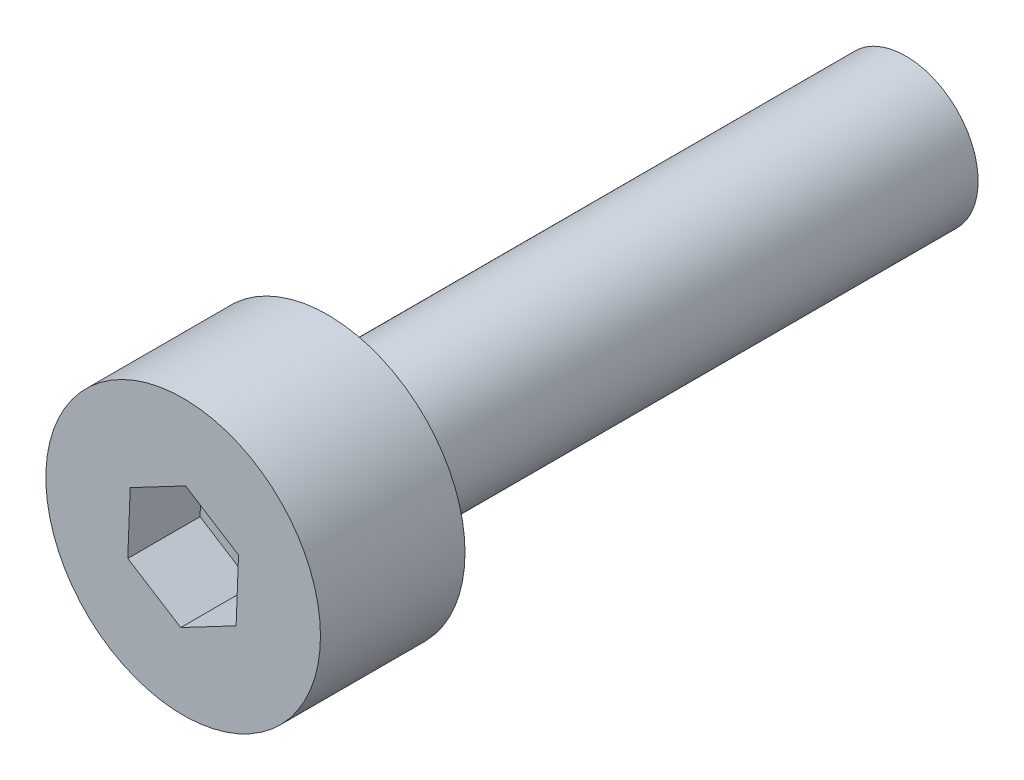
ISO-10303-21;
HEADER;
FILE_DESCRIPTION(('STEP AP214'),'2;1');
FILE_NAME('part.step','',(''),(''),'','','');
FILE_SCHEMA(('AUTOMOTIVE_DESIGN { 1 0 10303 214 1 1 1 1 }'));
ENDSEC;
DATA;
#1=APPLICATION_CONTEXT('core data for automotive mechanical design processes');
#2=APPLICATION_PROTOCOL_DEFINITION('international standard','automotive_design',2000,#1);
#3=PRODUCT_CONTEXT('',#1,'mechanical');
#4=PRODUCT('Part','Part','',(#3));
#5=PRODUCT_RELATED_PRODUCT_CATEGORY('part','',(#4));
#6=PRODUCT_DEFINITION_FORMATION('','',#4);
#7=PRODUCT_DEFINITION_CONTEXT('part definition',#1,'design');
#8=PRODUCT_DEFINITION('design','',#6,#7);
#9=PRODUCT_DEFINITION_SHAPE('','',#8);
#10=(LENGTH_UNIT() NAMED_UNIT(*) SI_UNIT(.MILLI.,.METRE.));
#11=(NAMED_UNIT(*) PLANE_ANGLE_UNIT() SI_UNIT($,.RADIAN.));
#12=(NAMED_UNIT(*) SI_UNIT($,.STERADIAN.) SOLID_ANGLE_UNIT());
#13=UNCERTAINTY_MEASURE_WITH_UNIT(LENGTH_MEASURE(1.E-05),#10,'distance_accuracy_value','');
#14=(GEOMETRIC_REPRESENTATION_CONTEXT(3) GLOBAL_UNCERTAINTY_ASSIGNED_CONTEXT((#13)) GLOBAL_UNIT_ASSIGNED_CONTEXT((#10,
#11,#12)) REPRESENTATION_CONTEXT('',''));
#15=CARTESIAN_POINT('',(0.,0.,0.));
#16=DIRECTION('',(0.,0.,1.));
#17=DIRECTION('',(1.,0.,0.));
#18=AXIS2_PLACEMENT_3D('',#15,#16,#17);
#19=CARTESIAN_POINT('',(0.,0.,2.));
#20=DIRECTION('',(0.,0.,-1.));
#21=DIRECTION('',(-1.,0.,0.));
#22=AXIS2_PLACEMENT_3D('',#19,#20,#21);
#23=CYLINDRICAL_SURFACE('',#22,1.9);
#24=CARTESIAN_POINT('',(0.,0.,2.));
#25=DIRECTION('',(0.,0.,1.));
#26=DIRECTION('',(1.,0.,0.));
#27=AXIS2_PLACEMENT_3D('',#24,#25,#26);
#28=CIRCLE('',#27,1.9);
#29=CARTESIAN_POINT('',(1.9,0.,2.));
#30=VERTEX_POINT('',#29);
#31=EDGE_CURVE('E45',#30,#30,#28,.T.);
#32=ORIENTED_EDGE('',*,*,#31,.F.);
#33=EDGE_LOOP('',(#32));
#34=FACE_BOUND('',#33,.T.);
#35=CARTESIAN_POINT('',(0.,0.,0.));
#36=DIRECTION('',(0.,0.,1.));
#37=DIRECTION('',(1.,0.,0.));
#38=AXIS2_PLACEMENT_3D('',#35,#36,#37);
#39=CIRCLE('',#38,1.9);
#40=CARTESIAN_POINT('',(1.9,0.,0.));
#41=VERTEX_POINT('',#40);
#42=EDGE_CURVE('E40',#41,#41,#39,.T.);
#43=ORIENTED_EDGE('',*,*,#42,.T.);
#44=EDGE_LOOP('',(#43));
#45=FACE_BOUND('',#44,.T.);
#46=ADVANCED_FACE('F37',(#34,#45),#23,.T.);
#47=CARTESIAN_POINT('',(0.,0.,2.));
#48=DIRECTION('',(0.,0.,1.));
#49=DIRECTION('',(1.,0.,0.));
#50=AXIS2_PLACEMENT_3D('',#47,#48,#49);
#51=PLANE('',#50);
#52=DIRECTION('',(0.845991028125538,-0.533197130835394,0.));
#53=VECTOR('',#52,1.);
#54=CARTESIAN_POINT('',(-0.399897848126545,-0.634493271094153,2.));
#55=LINE('',#54,#53);
#56=CARTESIAN_POINT('',(-0.76622270899176,-0.40361214082994,2.));
#57=VERTEX_POINT('',#56);
#58=CARTESIAN_POINT('',(-0.0335729872613293,-0.865374401358366,2.));
#59=VERTEX_POINT('',#58);
#60=EDGE_CURVE('E53',#57,#59,#55,.T.);
#61=ORIENTED_EDGE('',*,*,#60,.F.);
#62=DIRECTION('',(-0.0387667464656569,-0.999248287148128,0.));
#63=VECTOR('',#62,1.);
#64=CARTESIAN_POINT('',(-0.749436215361096,0.0290750598492427,2.));
#65=LINE('',#64,#63);
#66=CARTESIAN_POINT('',(-0.732649721730431,0.461762260528426,2.));
#67=VERTEX_POINT('',#66);
#68=EDGE_CURVE('E136',#67,#57,#65,.T.);
#69=ORIENTED_EDGE('',*,*,#68,.F.);
#70=DIRECTION('',(-0.884757774591195,-0.466051156312735,0.));
#71=VECTOR('',#70,1.);
#72=CARTESIAN_POINT('',(-0.349538367234551,0.663568330943396,2.));
#73=LINE('',#72,#71);
#74=CARTESIAN_POINT('',(0.0335729872613296,0.865374401358366,2.));
#75=VERTEX_POINT('',#74);
#76=EDGE_CURVE('E134',#75,#67,#73,.T.);
#77=ORIENTED_EDGE('',*,*,#76,.F.);
#78=DIRECTION('',(-0.845991028125538,0.533197130835393,0.));
#79=VECTOR('',#78,1.);
#80=CARTESIAN_POINT('',(0.399897848126545,0.634493271094153,2.));
#81=LINE('',#80,#79);
#82=CARTESIAN_POINT('',(0.766222708991761,0.40361214082994,2.));
#83=VERTEX_POINT('',#82);
#84=EDGE_CURVE('E101',#83,#75,#81,.T.);
#85=ORIENTED_EDGE('',*,*,#84,.F.);
#86=DIRECTION('',(0.0387667464656569,0.999248287148128,0.));
#87=VECTOR('',#86,1.);
#88=CARTESIAN_POINT('',(0.749436215361096,-0.0290750598492427,2.));
#89=LINE('',#88,#87);
#90=CARTESIAN_POINT('',(0.732649721730431,-0.461762260528426,2.));
#91=VERTEX_POINT('',#90);
#92=EDGE_CURVE('E130',#91,#83,#89,.T.);
#93=ORIENTED_EDGE('',*,*,#92,.F.);
#94=DIRECTION('',(0.884757774591195,0.466051156312735,0.));
#95=VECTOR('',#94,1.);
#96=CARTESIAN_POINT('',(0.349538367234551,-0.663568330943396,2.));
#97=LINE('',#96,#95);
#98=EDGE_CURVE('E127',#59,#91,#97,.T.);
#99=ORIENTED_EDGE('',*,*,#98,.F.);
#100=EDGE_LOOP('',(#61,#69,#77,#85,#93,#99));
#101=FACE_BOUND('',#100,.T.);
#102=ORIENTED_EDGE('',*,*,#31,.T.);
#103=EDGE_LOOP('',(#102));
#104=FACE_BOUND('',#103,.T.);
#105=ADVANCED_FACE('F157',(#101,#104),#51,.T.);
#106=CARTESIAN_POINT('',(0.,0.,0.));
#107=DIRECTION('',(0.,0.,1.));
#108=DIRECTION('',(1.,0.,0.));
#109=AXIS2_PLACEMENT_3D('',#106,#107,#108);
#110=PLANE('',#109);
#111=CARTESIAN_POINT('',(0.,0.,0.));
#112=DIRECTION('',(0.,0.,-1.));
#113=DIRECTION('',(-1.,0.,0.));
#114=AXIS2_PLACEMENT_3D('',#111,#112,#113);
#115=CIRCLE('',#114,1.);
#116=CARTESIAN_POINT('',(-1.,0.,0.));
#117=VERTEX_POINT('',#116);
#118=EDGE_CURVE('E11',#117,#117,#115,.T.);
#119=ORIENTED_EDGE('',*,*,#118,.F.);
#120=EDGE_LOOP('',(#119));
#121=FACE_BOUND('',#120,.T.);
#122=ORIENTED_EDGE('',*,*,#42,.F.);
#123=EDGE_LOOP('',(#122));
#124=FACE_BOUND('',#123,.T.);
#125=ADVANCED_FACE('F154',(#121,#124),#110,.F.);
#126=CARTESIAN_POINT('',(0.,0.,-8.));
#127=DIRECTION('',(0.,0.,1.));
#128=DIRECTION('',(1.,0.,0.));
#129=AXIS2_PLACEMENT_3D('',#126,#127,#128);
#130=CYLINDRICAL_SURFACE('',#129,1.);
#131=CARTESIAN_POINT('',(0.,0.,-8.));
#132=DIRECTION('',(0.,0.,-1.));
#133=DIRECTION('',(-1.,0.,0.));
#134=AXIS2_PLACEMENT_3D('',#131,#132,#133);
#135=CIRCLE('',#134,1.);
#136=CARTESIAN_POINT('',(-1.,0.,-8.));
#137=VERTEX_POINT('',#136);
#138=EDGE_CURVE('E140',#137,#137,#135,.T.);
#139=ORIENTED_EDGE('',*,*,#138,.F.);
#140=EDGE_LOOP('',(#139));
#141=FACE_BOUND('',#140,.T.);
#142=ORIENTED_EDGE('',*,*,#118,.T.);
#143=EDGE_LOOP('',(#142));
#144=FACE_BOUND('',#143,.T.);
#145=ADVANCED_FACE('F156',(#141,#144),#130,.T.);
#146=CARTESIAN_POINT('',(0.,0.,-8.));
#147=DIRECTION('',(0.,0.,-1.));
#148=DIRECTION('',(-1.,0.,0.));
#149=AXIS2_PLACEMENT_3D('',#146,#147,#148);
#150=PLANE('',#149);
#151=ORIENTED_EDGE('',*,*,#138,.T.);
#152=EDGE_LOOP('',(#151));
#153=FACE_BOUND('',#152,.T.);
#154=ADVANCED_FACE('F163',(#153),#150,.T.);
#155=CARTESIAN_POINT('',(-0.399897848126545,-0.634493271094153,1.));
#156=DIRECTION('',(-0.533197130835394,-0.845991028125538,0.));
#157=DIRECTION('',(0.845991028125538,-0.533197130835394,0.));
#158=AXIS2_PLACEMENT_3D('',#155,#156,#157);
#159=PLANE('',#158);
#160=ORIENTED_EDGE('',*,*,#60,.T.);
#161=DIRECTION('',(0.,0.,1.));
#162=VECTOR('',#161,1.);
#163=CARTESIAN_POINT('',(-0.0335729872613293,-0.865374401358366,1.));
#164=LINE('',#163,#162);
#165=CARTESIAN_POINT('',(-0.0335729872613293,-0.865374401358366,1.));
#166=VERTEX_POINT('',#165);
#167=EDGE_CURVE('E83',#166,#59,#164,.T.);
#168=ORIENTED_EDGE('',*,*,#167,.F.);
#169=DIRECTION('',(0.845991028125538,-0.533197130835394,0.));
#170=VECTOR('',#169,1.);
#171=CARTESIAN_POINT('',(-0.399897848126545,-0.634493271094153,1.));
#172=LINE('',#171,#170);
#173=CARTESIAN_POINT('',(-0.76622270899176,-0.40361214082994,1.));
#174=VERTEX_POINT('',#173);
#175=EDGE_CURVE('E138',#174,#166,#172,.T.);
#176=ORIENTED_EDGE('',*,*,#175,.F.);
#177=DIRECTION('',(0.,0.,1.));
#178=VECTOR('',#177,1.);
#179=CARTESIAN_POINT('',(-0.76622270899176,-0.40361214082994,1.));
#180=LINE('',#179,#178);
#181=EDGE_CURVE('E61',#174,#57,#180,.T.);
#182=ORIENTED_EDGE('',*,*,#181,.T.);
#183=EDGE_LOOP('',(#160,#168,#176,#182));
#184=FACE_BOUND('',#183,.T.);
#185=ADVANCED_FACE('F188',(#184),#159,.F.);
#186=CARTESIAN_POINT('',(-0.749436215361096,0.0290750598492427,1.));
#187=DIRECTION('',(-0.999248287148128,0.0387667464656569,0.));
#188=DIRECTION('',(-0.0387667464656569,-0.999248287148128,0.));
#189=AXIS2_PLACEMENT_3D('',#186,#187,#188);
#190=PLANE('',#189);
#191=ORIENTED_EDGE('',*,*,#68,.T.);
#192=ORIENTED_EDGE('',*,*,#181,.F.);
#193=DIRECTION('',(-0.0387667464656569,-0.999248287148128,0.));
#194=VECTOR('',#193,1.);
#195=CARTESIAN_POINT('',(-0.749436215361096,0.0290750598492427,1.));
#196=LINE('',#195,#194);
#197=CARTESIAN_POINT('',(-0.732649721730431,0.461762260528426,1.));
#198=VERTEX_POINT('',#197);
#199=EDGE_CURVE('E113',#198,#174,#196,.T.);
#200=ORIENTED_EDGE('',*,*,#199,.F.);
#201=DIRECTION('',(0.,0.,1.));
#202=VECTOR('',#201,1.);
#203=CARTESIAN_POINT('',(-0.732649721730431,0.461762260528426,1.));
#204=LINE('',#203,#202);
#205=EDGE_CURVE('E105',#198,#67,#204,.T.);
#206=ORIENTED_EDGE('',*,*,#205,.T.);
#207=EDGE_LOOP('',(#191,#192,#200,#206));
#208=FACE_BOUND('',#207,.T.);
#209=ADVANCED_FACE('F193',(#208),#190,.F.);
#210=CARTESIAN_POINT('',(-0.349538367234551,0.663568330943396,1.));
#211=DIRECTION('',(-0.466051156312734,0.884757774591195,0.));
#212=DIRECTION('',(-0.884757774591195,-0.466051156312734,0.));
#213=AXIS2_PLACEMENT_3D('',#210,#211,#212);
#214=PLANE('',#213);
#215=ORIENTED_EDGE('',*,*,#76,.T.);
#216=ORIENTED_EDGE('',*,*,#205,.F.);
#217=DIRECTION('',(-0.884757774591195,-0.466051156312735,0.));
#218=VECTOR('',#217,1.);
#219=CARTESIAN_POINT('',(-0.349538367234551,0.663568330943396,1.));
#220=LINE('',#219,#218);
#221=CARTESIAN_POINT('',(0.0335729872613296,0.865374401358366,1.));
#222=VERTEX_POINT('',#221);
#223=EDGE_CURVE('E109',#222,#198,#220,.T.);
#224=ORIENTED_EDGE('',*,*,#223,.F.);
#225=DIRECTION('',(0.,0.,1.));
#226=VECTOR('',#225,1.);
#227=CARTESIAN_POINT('',(0.0335729872613296,0.865374401358366,1.));
#228=LINE('',#227,#226);
#229=EDGE_CURVE('E94',#222,#75,#228,.T.);
#230=ORIENTED_EDGE('',*,*,#229,.T.);
#231=EDGE_LOOP('',(#215,#216,#224,#230));
#232=FACE_BOUND('',#231,.T.);
#233=ADVANCED_FACE('F110',(#232),#214,.F.);
#234=CARTESIAN_POINT('',(0.399897848126545,0.634493271094153,1.));
#235=DIRECTION('',(0.533197130835393,0.845991028125538,0.));
#236=DIRECTION('',(-0.845991028125538,0.533197130835393,0.));
#237=AXIS2_PLACEMENT_3D('',#234,#235,#236);
#238=PLANE('',#237);
#239=ORIENTED_EDGE('',*,*,#84,.T.);
#240=ORIENTED_EDGE('',*,*,#229,.F.);
#241=DIRECTION('',(-0.845991028125538,0.533197130835393,0.));
#242=VECTOR('',#241,1.);
#243=CARTESIAN_POINT('',(0.399897848126545,0.634493271094153,1.));
#244=LINE('',#243,#242);
#245=CARTESIAN_POINT('',(0.766222708991761,0.40361214082994,1.));
#246=VERTEX_POINT('',#245);
#247=EDGE_CURVE('E98',#246,#222,#244,.T.);
#248=ORIENTED_EDGE('',*,*,#247,.F.);
#249=DIRECTION('',(0.,0.,1.));
#250=VECTOR('',#249,1.);
#251=CARTESIAN_POINT('',(0.766222708991761,0.40361214082994,1.));
#252=LINE('',#251,#250);
#253=EDGE_CURVE('E106',#246,#83,#252,.T.);
#254=ORIENTED_EDGE('',*,*,#253,.T.);
#255=EDGE_LOOP('',(#239,#240,#248,#254));
#256=FACE_BOUND('',#255,.T.);
#257=ADVANCED_FACE('F96',(#256),#238,.F.);
#258=CARTESIAN_POINT('',(0.749436215361096,-0.0290750598492427,1.));
#259=DIRECTION('',(0.999248287148128,-0.0387667464656569,0.));
#260=DIRECTION('',(0.0387667464656569,0.999248287148128,0.));
#261=AXIS2_PLACEMENT_3D('',#258,#259,#260);
#262=PLANE('',#261);
#263=ORIENTED_EDGE('',*,*,#92,.T.);
#264=ORIENTED_EDGE('',*,*,#253,.F.);
#265=DIRECTION('',(0.0387667464656569,0.999248287148128,0.));
#266=VECTOR('',#265,1.);
#267=CARTESIAN_POINT('',(0.749436215361096,-0.0290750598492427,1.));
#268=LINE('',#267,#266);
#269=CARTESIAN_POINT('',(0.732649721730431,-0.461762260528426,1.));
#270=VERTEX_POINT('',#269);
#271=EDGE_CURVE('E119',#270,#246,#268,.T.);
#272=ORIENTED_EDGE('',*,*,#271,.F.);
#273=DIRECTION('',(0.,0.,1.));
#274=VECTOR('',#273,1.);
#275=CARTESIAN_POINT('',(0.732649721730431,-0.461762260528426,1.));
#276=LINE('',#275,#274);
#277=EDGE_CURVE('E143',#270,#91,#276,.T.);
#278=ORIENTED_EDGE('',*,*,#277,.T.);
#279=EDGE_LOOP('',(#263,#264,#272,#278));
#280=FACE_BOUND('',#279,.T.);
#281=ADVANCED_FACE('F218',(#280),#262,.F.);
#282=CARTESIAN_POINT('',(0.349538367234551,-0.663568330943396,1.));
#283=DIRECTION('',(0.466051156312735,-0.884757774591195,0.));
#284=DIRECTION('',(0.884757774591195,0.466051156312735,0.));
#285=AXIS2_PLACEMENT_3D('',#282,#283,#284);
#286=PLANE('',#285);
#287=ORIENTED_EDGE('',*,*,#98,.T.);
#288=ORIENTED_EDGE('',*,*,#277,.F.);
#289=DIRECTION('',(0.884757774591195,0.466051156312735,0.));
#290=VECTOR('',#289,1.);
#291=CARTESIAN_POINT('',(0.349538367234551,-0.663568330943396,1.));
#292=LINE('',#291,#290);
#293=EDGE_CURVE('E121',#166,#270,#292,.T.);
#294=ORIENTED_EDGE('',*,*,#293,.F.);
#295=ORIENTED_EDGE('',*,*,#167,.T.);
#296=EDGE_LOOP('',(#287,#288,#294,#295));
#297=FACE_BOUND('',#296,.T.);
#298=ADVANCED_FACE('F227',(#297),#286,.F.);
#299=CARTESIAN_POINT('',(0.,0.,1.));
#300=DIRECTION('',(0.,0.,1.));
#301=DIRECTION('',(1.,0.,0.));
#302=AXIS2_PLACEMENT_3D('',#299,#300,#301);
#303=PLANE('',#302);
#304=ORIENTED_EDGE('',*,*,#175,.T.);
#305=ORIENTED_EDGE('',*,*,#293,.T.);
#306=ORIENTED_EDGE('',*,*,#271,.T.);
#307=ORIENTED_EDGE('',*,*,#247,.T.);
#308=ORIENTED_EDGE('',*,*,#223,.T.);
#309=ORIENTED_EDGE('',*,*,#199,.T.);
#310=EDGE_LOOP('',(#304,#305,#306,#307,#308,#309));
#311=FACE_BOUND('',#310,.T.);
#312=ADVANCED_FACE('F116',(#311),#303,.T.);
#313=CLOSED_SHELL('',(#46,#105,#125,#145,#154,#185,#209,#233,#257,#281,#298,#312));
#314=MANIFOLD_SOLID_BREP('B2',#313);
#315=ADVANCED_BREP_SHAPE_REPRESENTATION('',(#18,#314),#14);
#316=SHAPE_DEFINITION_REPRESENTATION(#9,#315);
ENDSEC;
END-ISO-10303-21;
